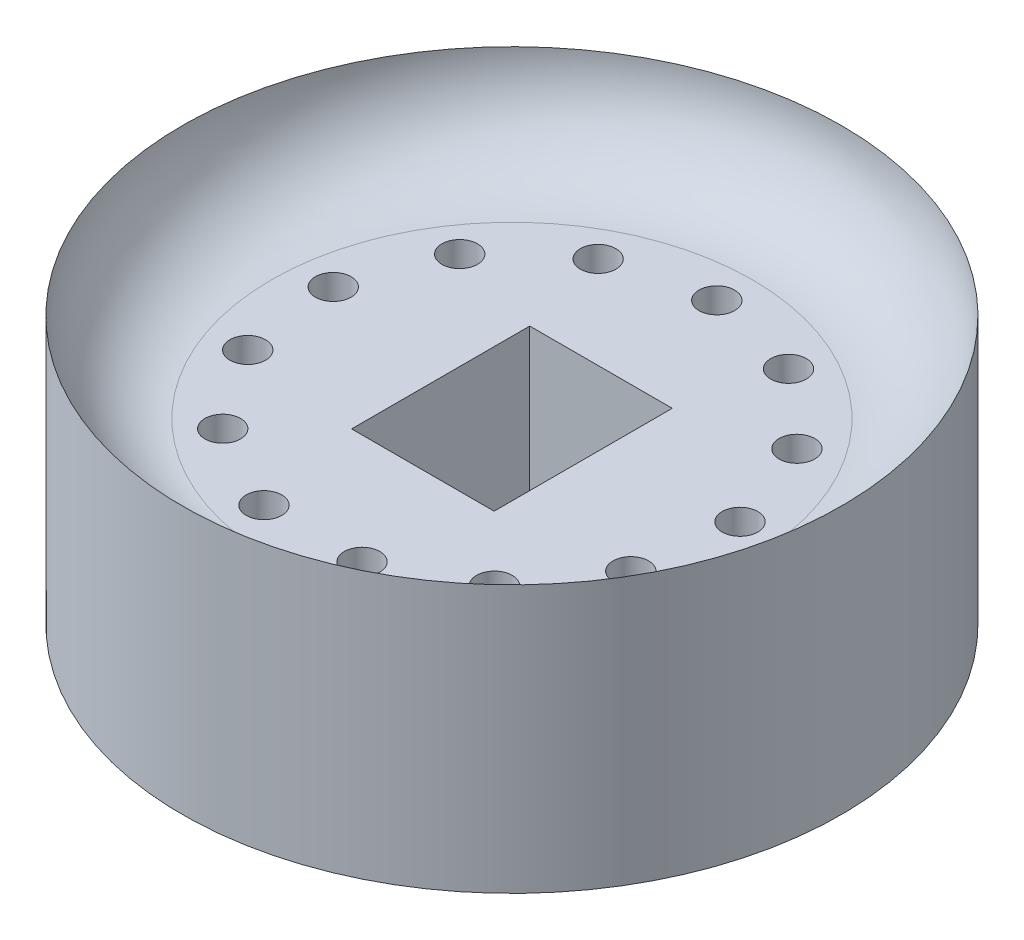
ISO-10303-21;
HEADER;
FILE_DESCRIPTION(('STEP AP214'),'2;1');
FILE_NAME('part.step','',(''),(''),'','','');
FILE_SCHEMA(('AUTOMOTIVE_DESIGN { 1 0 10303 214 1 1 1 1 }'));
ENDSEC;
DATA;
#1=APPLICATION_CONTEXT('core data for automotive mechanical design processes');
#2=APPLICATION_PROTOCOL_DEFINITION('international standard','automotive_design',2000,#1);
#3=PRODUCT_CONTEXT('',#1,'mechanical');
#4=PRODUCT('Part','Part','',(#3));
#5=PRODUCT_RELATED_PRODUCT_CATEGORY('part','',(#4));
#6=PRODUCT_DEFINITION_FORMATION('','',#4);
#7=PRODUCT_DEFINITION_CONTEXT('part definition',#1,'design');
#8=PRODUCT_DEFINITION('design','',#6,#7);
#9=PRODUCT_DEFINITION_SHAPE('','',#8);
#10=(LENGTH_UNIT() NAMED_UNIT(*) SI_UNIT(.MILLI.,.METRE.));
#11=(NAMED_UNIT(*) PLANE_ANGLE_UNIT() SI_UNIT($,.RADIAN.));
#12=(NAMED_UNIT(*) SI_UNIT($,.STERADIAN.) SOLID_ANGLE_UNIT());
#13=UNCERTAINTY_MEASURE_WITH_UNIT(LENGTH_MEASURE(1.E-05),#10,'distance_accuracy_value','');
#14=(GEOMETRIC_REPRESENTATION_CONTEXT(3) GLOBAL_UNCERTAINTY_ASSIGNED_CONTEXT((#13)) GLOBAL_UNIT_ASSIGNED_CONTEXT((#10,
#11,#12)) REPRESENTATION_CONTEXT('',''));
#15=CARTESIAN_POINT('',(0.,0.,0.));
#16=DIRECTION('',(0.,0.,1.));
#17=DIRECTION('',(1.,0.,0.));
#18=AXIS2_PLACEMENT_3D('',#15,#16,#17);
#19=CARTESIAN_POINT('',(0.,7.5,0.));
#20=DIRECTION('',(0.,-1.,0.));
#21=DIRECTION('',(0.,0.,-1.));
#22=AXIS2_PLACEMENT_3D('',#19,#20,#21);
#23=TOROIDAL_SURFACE('',#22,6.75,2.5);
#24=CARTESIAN_POINT('',(0.,7.5,0.));
#25=DIRECTION('',(0.,-1.,0.));
#26=DIRECTION('',(0.,0.,-1.));
#27=AXIS2_PLACEMENT_3D('',#24,#25,#26);
#28=CIRCLE('',#27,9.25);
#29=CARTESIAN_POINT('',(0.,7.5,-9.25));
#30=VERTEX_POINT('',#29);
#31=EDGE_CURVE('E203',#30,#30,#28,.T.);
#32=ORIENTED_EDGE('',*,*,#31,.F.);
#33=EDGE_LOOP('',(#32));
#34=FACE_BOUND('',#33,.T.);
#35=CARTESIAN_POINT('',(0.,5.,0.));
#36=DIRECTION('',(0.,-1.,0.));
#37=DIRECTION('',(0.,0.,-1.));
#38=AXIS2_PLACEMENT_3D('',#35,#36,#37);
#39=CIRCLE('',#38,6.75);
#40=CARTESIAN_POINT('',(0.,5.,-6.75));
#41=VERTEX_POINT('',#40);
#42=EDGE_CURVE('E11',#41,#41,#39,.T.);
#43=ORIENTED_EDGE('',*,*,#42,.T.);
#44=EDGE_LOOP('',(#43));
#45=FACE_BOUND('',#44,.T.);
#46=ADVANCED_FACE('F41',(#34,#45),#23,.F.);
#47=CARTESIAN_POINT('',(0.,5.,0.));
#48=DIRECTION('',(0.,1.,0.));
#49=DIRECTION('',(0.,0.,1.));
#50=AXIS2_PLACEMENT_3D('',#47,#48,#49);
#51=PLANE('',#50);
#52=CARTESIAN_POINT('',(-2.67215823925165,5.,-5.09137214750587));
#53=DIRECTION('',(0.,1.,0.));
#54=DIRECTION('',(0.,0.,1.));
#55=AXIS2_PLACEMENT_3D('',#52,#53,#54);
#56=CIRCLE('',#55,0.5);
#57=CARTESIAN_POINT('',(-2.67215823925165,5.,-4.59137214750587));
#58=VERTEX_POINT('',#57);
#59=EDGE_CURVE('E195',#58,#58,#56,.T.);
#60=ORIENTED_EDGE('',*,*,#59,.F.);
#61=EDGE_LOOP('',(#60));
#62=FACE_BOUND('',#61,.T.);
#63=CARTESIAN_POINT('',(-4.73215722888845,5.,-3.26637229370399));
#64=DIRECTION('',(0.,1.,0.));
#65=DIRECTION('',(0.,0.,1.));
#66=AXIS2_PLACEMENT_3D('',#63,#64,#65);
#67=CIRCLE('',#66,0.5);
#68=CARTESIAN_POINT('',(-4.73215722888845,5.,-2.76637229370399));
#69=VERTEX_POINT('',#68);
#70=EDGE_CURVE('E187',#69,#69,#67,.T.);
#71=ORIENTED_EDGE('',*,*,#70,.F.);
#72=EDGE_LOOP('',(#71));
#73=FACE_BOUND('',#72,.T.);
#74=CARTESIAN_POINT('',(-5.70807602606365,5.,-0.693085911467919));
#75=DIRECTION('',(0.,1.,0.));
#76=DIRECTION('',(0.,0.,1.));
#77=AXIS2_PLACEMENT_3D('',#74,#75,#76);
#78=CIRCLE('',#77,0.500000000000001);
#79=CARTESIAN_POINT('',(-5.70807602606365,5.,-0.193085911467918));
#80=VERTEX_POINT('',#79);
#81=EDGE_CURVE('E179',#80,#80,#78,.T.);
#82=ORIENTED_EDGE('',*,*,#81,.F.);
#83=EDGE_LOOP('',(#82));
#84=FACE_BOUND('',#83,.T.);
#85=CARTESIAN_POINT('',(-5.37634339544088,5.,2.03897810049475));
#86=DIRECTION('',(0.,1.,0.));
#87=DIRECTION('',(0.,0.,1.));
#88=AXIS2_PLACEMENT_3D('',#85,#86,#87);
#89=CIRCLE('',#88,0.500000000000001);
#90=CARTESIAN_POINT('',(-5.37634339544088,5.,2.53897810049476));
#91=VERTEX_POINT('',#90);
#92=EDGE_CURVE('E171',#91,#91,#89,.T.);
#93=ORIENTED_EDGE('',*,*,#92,.F.);
#94=EDGE_LOOP('',(#93));
#95=FACE_BOUND('',#94,.T.);
#96=CARTESIAN_POINT('',(-3.81295528488425,5.,4.30393680198396));
#97=DIRECTION('',(0.,1.,0.));
#98=DIRECTION('',(0.,0.,1.));
#99=AXIS2_PLACEMENT_3D('',#96,#97,#98);
#100=CIRCLE('',#99,0.5);
#101=CARTESIAN_POINT('',(-3.81295528488425,5.,4.80393680198396));
#102=VERTEX_POINT('',#101);
#103=EDGE_CURVE('E163',#102,#102,#100,.T.);
#104=ORIENTED_EDGE('',*,*,#103,.F.);
#105=EDGE_LOOP('',(#104));
#106=FACE_BOUND('',#105,.T.);
#107=DIRECTION('',(0.,0.,-1.));
#108=VECTOR('',#107,1.);
#109=CARTESIAN_POINT('',(2.,5.,2.5));
#110=LINE('',#109,#108);
#111=CARTESIAN_POINT('',(2.,5.,2.5));
#112=VERTEX_POINT('',#111);
#113=CARTESIAN_POINT('',(2.,5.,-2.5));
#114=VERTEX_POINT('',#113);
#115=EDGE_CURVE('E56',#112,#114,#110,.T.);
#116=ORIENTED_EDGE('',*,*,#115,.F.);
#117=DIRECTION('',(1.,0.,0.));
#118=VECTOR('',#117,1.);
#119=CARTESIAN_POINT('',(-2.,5.,2.5));
#120=LINE('',#119,#118);
#121=CARTESIAN_POINT('',(-2.,5.,2.5));
#122=VERTEX_POINT('',#121);
#123=EDGE_CURVE('E103',#122,#112,#120,.T.);
#124=ORIENTED_EDGE('',*,*,#123,.F.);
#125=DIRECTION('',(0.,0.,1.));
#126=VECTOR('',#125,1.);
#127=CARTESIAN_POINT('',(-2.,5.,2.5));
#128=LINE('',#127,#126);
#129=CARTESIAN_POINT('',(-2.,5.,-2.5));
#130=VERTEX_POINT('',#129);
#131=EDGE_CURVE('E107',#130,#122,#128,.T.);
#132=ORIENTED_EDGE('',*,*,#131,.F.);
#133=DIRECTION('',(-1.,0.,0.));
#134=VECTOR('',#133,1.);
#135=CARTESIAN_POINT('',(-2.,5.,-2.5));
#136=LINE('',#135,#134);
#137=EDGE_CURVE('E119',#114,#130,#136,.T.);
#138=ORIENTED_EDGE('',*,*,#137,.F.);
#139=EDGE_LOOP('',(#116,#124,#132,#138));
#140=FACE_BOUND('',#139,.T.);
#141=CARTESIAN_POINT('',(2.67215823925169,5.,-5.09137214750605));
#142=DIRECTION('',(0.,1.,0.));
#143=DIRECTION('',(0.,0.,1.));
#144=AXIS2_PLACEMENT_3D('',#141,#142,#143);
#145=CIRCLE('',#144,0.5);
#146=CARTESIAN_POINT('',(2.67215823925169,5.,-4.59137214750604));
#147=VERTEX_POINT('',#146);
#148=EDGE_CURVE('E138',#147,#147,#145,.T.);
#149=ORIENTED_EDGE('',*,*,#148,.F.);
#150=EDGE_LOOP('',(#149));
#151=FACE_BOUND('',#150,.T.);
#152=CARTESIAN_POINT('',(4.7321572288886,5.,-3.2663722937043));
#153=DIRECTION('',(0.,1.,0.));
#154=DIRECTION('',(0.,0.,1.));
#155=AXIS2_PLACEMENT_3D('',#152,#153,#154);
#156=CIRCLE('',#155,0.5);
#157=CARTESIAN_POINT('',(4.7321572288886,5.,-2.7663722937043));
#158=VERTEX_POINT('',#157);
#159=EDGE_CURVE('E146',#158,#158,#156,.T.);
#160=ORIENTED_EDGE('',*,*,#159,.F.);
#161=EDGE_LOOP('',(#160));
#162=FACE_BOUND('',#161,.T.);
#163=CARTESIAN_POINT('',(5.70807602606397,5.,-0.693085911468293));
#164=DIRECTION('',(0.,1.,0.));
#165=DIRECTION('',(0.,0.,1.));
#166=AXIS2_PLACEMENT_3D('',#163,#164,#165);
#167=CIRCLE('',#166,0.500000000000001);
#168=CARTESIAN_POINT('',(5.70807602606397,5.,-0.193085911468292));
#169=VERTEX_POINT('',#168);
#170=EDGE_CURVE('E154',#169,#169,#167,.T.);
#171=ORIENTED_EDGE('',*,*,#170,.F.);
#172=EDGE_LOOP('',(#171));
#173=FACE_BOUND('',#172,.T.);
#174=CARTESIAN_POINT('',(5.37634339544139,5.,2.03897810049441));
#175=DIRECTION('',(0.,1.,0.));
#176=DIRECTION('',(0.,0.,1.));
#177=AXIS2_PLACEMENT_3D('',#174,#175,#176);
#178=CIRCLE('',#177,0.500000000000001);
#179=CARTESIAN_POINT('',(5.37634339544139,5.,2.53897810049441));
#180=VERTEX_POINT('',#179);
#181=EDGE_CURVE('E262',#180,#180,#178,.T.);
#182=ORIENTED_EDGE('',*,*,#181,.F.);
#183=EDGE_LOOP('',(#182));
#184=FACE_BOUND('',#183,.T.);
#185=CARTESIAN_POINT('',(3.8129552848849,5.,4.30393680198371));
#186=DIRECTION('',(0.,1.,0.));
#187=DIRECTION('',(0.,0.,1.));
#188=AXIS2_PLACEMENT_3D('',#185,#186,#187);
#189=CIRCLE('',#188,0.500000000000001);
#190=CARTESIAN_POINT('',(3.8129552848849,5.,4.80393680198371));
#191=VERTEX_POINT('',#190);
#192=EDGE_CURVE('E266',#191,#191,#189,.T.);
#193=ORIENTED_EDGE('',*,*,#192,.F.);
#194=EDGE_LOOP('',(#193));
#195=FACE_BOUND('',#194,.T.);
#196=CARTESIAN_POINT('',(1.37606506965382,5.,5.58291545019975));
#197=DIRECTION('',(0.,1.,0.));
#198=DIRECTION('',(0.,0.,1.));
#199=AXIS2_PLACEMENT_3D('',#196,#197,#198);
#200=CIRCLE('',#199,0.499999999999999);
#201=CARTESIAN_POINT('',(1.37606506965382,5.,6.08291545019975));
#202=VERTEX_POINT('',#201);
#203=EDGE_CURVE('E270',#202,#202,#200,.T.);
#204=ORIENTED_EDGE('',*,*,#203,.F.);
#205=EDGE_LOOP('',(#204));
#206=FACE_BOUND('',#205,.T.);
#207=CARTESIAN_POINT('',(-1.37606506965309,5.,5.58291545019984));
#208=DIRECTION('',(0.,1.,0.));
#209=DIRECTION('',(0.,0.,1.));
#210=AXIS2_PLACEMENT_3D('',#207,#208,#209);
#211=CIRCLE('',#210,0.5);
#212=CARTESIAN_POINT('',(-1.37606506965309,5.,6.08291545019984));
#213=VERTEX_POINT('',#212);
#214=EDGE_CURVE('E110',#213,#213,#211,.T.);
#215=ORIENTED_EDGE('',*,*,#214,.F.);
#216=EDGE_LOOP('',(#215));
#217=FACE_BOUND('',#216,.T.);
#218=CARTESIAN_POINT('',(0.,5.,-5.75));
#219=DIRECTION('',(0.,1.,0.));
#220=DIRECTION('',(0.,0.,1.));
#221=AXIS2_PLACEMENT_3D('',#218,#219,#220);
#222=CIRCLE('',#221,0.5);
#223=CARTESIAN_POINT('',(0.,5.,-5.25));
#224=VERTEX_POINT('',#223);
#225=EDGE_CURVE('E129',#224,#224,#222,.T.);
#226=ORIENTED_EDGE('',*,*,#225,.F.);
#227=EDGE_LOOP('',(#226));
#228=FACE_BOUND('',#227,.T.);
#229=ORIENTED_EDGE('',*,*,#42,.F.);
#230=EDGE_LOOP('',(#229));
#231=FACE_BOUND('',#230,.T.);
#232=ADVANCED_FACE('F226',(#62,#73,#84,#95,#106,#140,#151,#162,#173,#184,#195,#206,#217,#228,
#231),#51,.T.);
#233=CARTESIAN_POINT('',(0.,0.,0.));
#234=DIRECTION('',(0.,-1.,0.));
#235=DIRECTION('',(0.,0.,-1.));
#236=AXIS2_PLACEMENT_3D('',#233,#234,#235);
#237=PLANE('',#236);
#238=CARTESIAN_POINT('',(-2.67215823925165,0.,-5.09137214750587));
#239=DIRECTION('',(0.,1.,0.));
#240=DIRECTION('',(0.,0.,1.));
#241=AXIS2_PLACEMENT_3D('',#238,#239,#240);
#242=CIRCLE('',#241,0.5);
#243=CARTESIAN_POINT('',(-2.67215823925165,0.,-4.59137214750587));
#244=VERTEX_POINT('',#243);
#245=EDGE_CURVE('E191',#244,#244,#242,.T.);
#246=ORIENTED_EDGE('',*,*,#245,.T.);
#247=EDGE_LOOP('',(#246));
#248=FACE_BOUND('',#247,.T.);
#249=CARTESIAN_POINT('',(-4.73215722888845,0.,-3.26637229370399));
#250=DIRECTION('',(0.,1.,0.));
#251=DIRECTION('',(0.,0.,1.));
#252=AXIS2_PLACEMENT_3D('',#249,#250,#251);
#253=CIRCLE('',#252,0.5);
#254=CARTESIAN_POINT('',(-4.73215722888845,0.,-2.76637229370399));
#255=VERTEX_POINT('',#254);
#256=EDGE_CURVE('E183',#255,#255,#253,.T.);
#257=ORIENTED_EDGE('',*,*,#256,.T.);
#258=EDGE_LOOP('',(#257));
#259=FACE_BOUND('',#258,.T.);
#260=CARTESIAN_POINT('',(-5.70807602606365,0.,-0.693085911467919));
#261=DIRECTION('',(0.,1.,0.));
#262=DIRECTION('',(0.,0.,1.));
#263=AXIS2_PLACEMENT_3D('',#260,#261,#262);
#264=CIRCLE('',#263,0.500000000000001);
#265=CARTESIAN_POINT('',(-5.70807602606365,0.,-0.193085911467918));
#266=VERTEX_POINT('',#265);
#267=EDGE_CURVE('E175',#266,#266,#264,.T.);
#268=ORIENTED_EDGE('',*,*,#267,.T.);
#269=EDGE_LOOP('',(#268));
#270=FACE_BOUND('',#269,.T.);
#271=CARTESIAN_POINT('',(-5.37634339544088,0.,2.03897810049475));
#272=DIRECTION('',(0.,1.,0.));
#273=DIRECTION('',(0.,0.,1.));
#274=AXIS2_PLACEMENT_3D('',#271,#272,#273);
#275=CIRCLE('',#274,0.500000000000001);
#276=CARTESIAN_POINT('',(-5.37634339544088,0.,2.53897810049476));
#277=VERTEX_POINT('',#276);
#278=EDGE_CURVE('E167',#277,#277,#275,.T.);
#279=ORIENTED_EDGE('',*,*,#278,.T.);
#280=EDGE_LOOP('',(#279));
#281=FACE_BOUND('',#280,.T.);
#282=CARTESIAN_POINT('',(-3.81295528488425,0.,4.30393680198396));
#283=DIRECTION('',(0.,1.,0.));
#284=DIRECTION('',(0.,0.,1.));
#285=AXIS2_PLACEMENT_3D('',#282,#283,#284);
#286=CIRCLE('',#285,0.5);
#287=CARTESIAN_POINT('',(-3.81295528488425,0.,4.80393680198396));
#288=VERTEX_POINT('',#287);
#289=EDGE_CURVE('E159',#288,#288,#286,.T.);
#290=ORIENTED_EDGE('',*,*,#289,.T.);
#291=EDGE_LOOP('',(#290));
#292=FACE_BOUND('',#291,.T.);
#293=DIRECTION('',(0.,0.,-1.));
#294=VECTOR('',#293,1.);
#295=CARTESIAN_POINT('',(2.,0.,2.5));
#296=LINE('',#295,#294);
#297=CARTESIAN_POINT('',(2.,0.,2.5));
#298=VERTEX_POINT('',#297);
#299=CARTESIAN_POINT('',(2.,0.,-2.5));
#300=VERTEX_POINT('',#299);
#301=EDGE_CURVE('E84',#298,#300,#296,.T.);
#302=ORIENTED_EDGE('',*,*,#301,.T.);
#303=DIRECTION('',(-1.,0.,0.));
#304=VECTOR('',#303,1.);
#305=CARTESIAN_POINT('',(-2.,0.,-2.5));
#306=LINE('',#305,#304);
#307=CARTESIAN_POINT('',(-2.,0.,-2.5));
#308=VERTEX_POINT('',#307);
#309=EDGE_CURVE('E94',#300,#308,#306,.T.);
#310=ORIENTED_EDGE('',*,*,#309,.T.);
#311=DIRECTION('',(0.,0.,1.));
#312=VECTOR('',#311,1.);
#313=CARTESIAN_POINT('',(-2.,0.,2.5));
#314=LINE('',#313,#312);
#315=CARTESIAN_POINT('',(-2.,0.,2.5));
#316=VERTEX_POINT('',#315);
#317=EDGE_CURVE('E64',#308,#316,#314,.T.);
#318=ORIENTED_EDGE('',*,*,#317,.T.);
#319=DIRECTION('',(1.,0.,0.));
#320=VECTOR('',#319,1.);
#321=CARTESIAN_POINT('',(-2.,0.,2.5));
#322=LINE('',#321,#320);
#323=EDGE_CURVE('E91',#316,#298,#322,.T.);
#324=ORIENTED_EDGE('',*,*,#323,.T.);
#325=EDGE_LOOP('',(#302,#310,#318,#324));
#326=FACE_BOUND('',#325,.T.);
#327=CARTESIAN_POINT('',(2.67215823925169,0.,-5.09137214750605));
#328=DIRECTION('',(0.,1.,0.));
#329=DIRECTION('',(0.,0.,1.));
#330=AXIS2_PLACEMENT_3D('',#327,#328,#329);
#331=CIRCLE('',#330,0.5);
#332=CARTESIAN_POINT('',(2.67215823925169,0.,-4.59137214750604));
#333=VERTEX_POINT('',#332);
#334=EDGE_CURVE('E120',#333,#333,#331,.T.);
#335=ORIENTED_EDGE('',*,*,#334,.T.);
#336=EDGE_LOOP('',(#335));
#337=FACE_BOUND('',#336,.T.);
#338=CARTESIAN_POINT('',(4.7321572288886,0.,-3.2663722937043));
#339=DIRECTION('',(0.,1.,0.));
#340=DIRECTION('',(0.,0.,1.));
#341=AXIS2_PLACEMENT_3D('',#338,#339,#340);
#342=CIRCLE('',#341,0.5);
#343=CARTESIAN_POINT('',(4.7321572288886,0.,-2.7663722937043));
#344=VERTEX_POINT('',#343);
#345=EDGE_CURVE('E142',#344,#344,#342,.T.);
#346=ORIENTED_EDGE('',*,*,#345,.T.);
#347=EDGE_LOOP('',(#346));
#348=FACE_BOUND('',#347,.T.);
#349=CARTESIAN_POINT('',(5.70807602606397,0.,-0.693085911468293));
#350=DIRECTION('',(0.,1.,0.));
#351=DIRECTION('',(0.,0.,1.));
#352=AXIS2_PLACEMENT_3D('',#349,#350,#351);
#353=CIRCLE('',#352,0.500000000000001);
#354=CARTESIAN_POINT('',(5.70807602606397,0.,-0.193085911468292));
#355=VERTEX_POINT('',#354);
#356=EDGE_CURVE('E150',#355,#355,#353,.T.);
#357=ORIENTED_EDGE('',*,*,#356,.T.);
#358=EDGE_LOOP('',(#357));
#359=FACE_BOUND('',#358,.T.);
#360=CARTESIAN_POINT('',(5.37634339544139,0.,2.03897810049441));
#361=DIRECTION('',(0.,1.,0.));
#362=DIRECTION('',(0.,0.,1.));
#363=AXIS2_PLACEMENT_3D('',#360,#361,#362);
#364=CIRCLE('',#363,0.500000000000001);
#365=CARTESIAN_POINT('',(5.37634339544139,0.,2.53897810049441));
#366=VERTEX_POINT('',#365);
#367=EDGE_CURVE('E158',#366,#366,#364,.T.);
#368=ORIENTED_EDGE('',*,*,#367,.T.);
#369=EDGE_LOOP('',(#368));
#370=FACE_BOUND('',#369,.T.);
#371=CARTESIAN_POINT('',(3.8129552848849,0.,4.30393680198371));
#372=DIRECTION('',(0.,1.,0.));
#373=DIRECTION('',(0.,0.,1.));
#374=AXIS2_PLACEMENT_3D('',#371,#372,#373);
#375=CIRCLE('',#374,0.500000000000001);
#376=CARTESIAN_POINT('',(3.8129552848849,0.,4.80393680198371));
#377=VERTEX_POINT('',#376);
#378=EDGE_CURVE('E292',#377,#377,#375,.T.);
#379=ORIENTED_EDGE('',*,*,#378,.T.);
#380=EDGE_LOOP('',(#379));
#381=FACE_BOUND('',#380,.T.);
#382=CARTESIAN_POINT('',(1.37606506965382,0.,5.58291545019975));
#383=DIRECTION('',(0.,1.,0.));
#384=DIRECTION('',(0.,0.,1.));
#385=AXIS2_PLACEMENT_3D('',#382,#383,#384);
#386=CIRCLE('',#385,0.499999999999999);
#387=CARTESIAN_POINT('',(1.37606506965382,0.,6.08291545019975));
#388=VERTEX_POINT('',#387);
#389=EDGE_CURVE('E284',#388,#388,#386,.T.);
#390=ORIENTED_EDGE('',*,*,#389,.T.);
#391=EDGE_LOOP('',(#390));
#392=FACE_BOUND('',#391,.T.);
#393=CARTESIAN_POINT('',(-1.37606506965309,0.,5.58291545019984));
#394=DIRECTION('',(0.,1.,0.));
#395=DIRECTION('',(0.,0.,1.));
#396=AXIS2_PLACEMENT_3D('',#393,#394,#395);
#397=CIRCLE('',#396,0.5);
#398=CARTESIAN_POINT('',(-1.37606506965309,0.,6.08291545019984));
#399=VERTEX_POINT('',#398);
#400=EDGE_CURVE('E278',#399,#399,#397,.T.);
#401=ORIENTED_EDGE('',*,*,#400,.T.);
#402=EDGE_LOOP('',(#401));
#403=FACE_BOUND('',#402,.T.);
#404=CARTESIAN_POINT('',(0.,0.,-5.75));
#405=DIRECTION('',(0.,1.,0.));
#406=DIRECTION('',(0.,0.,1.));
#407=AXIS2_PLACEMENT_3D('',#404,#405,#406);
#408=CIRCLE('',#407,0.5);
#409=CARTESIAN_POINT('',(0.,0.,-5.25));
#410=VERTEX_POINT('',#409);
#411=EDGE_CURVE('E199',#410,#410,#408,.T.);
#412=ORIENTED_EDGE('',*,*,#411,.T.);
#413=EDGE_LOOP('',(#412));
#414=FACE_BOUND('',#413,.T.);
#415=CARTESIAN_POINT('',(0.,0.,0.));
#416=DIRECTION('',(0.,-1.,0.));
#417=DIRECTION('',(0.,0.,-1.));
#418=AXIS2_PLACEMENT_3D('',#415,#416,#417);
#419=CIRCLE('',#418,9.25);
#420=CARTESIAN_POINT('',(0.,0.,-9.25));
#421=VERTEX_POINT('',#420);
#422=EDGE_CURVE('E49',#421,#421,#419,.T.);
#423=ORIENTED_EDGE('',*,*,#422,.T.);
#424=EDGE_LOOP('',(#423));
#425=FACE_BOUND('',#424,.T.);
#426=ADVANCED_FACE('F99',(#248,#259,#270,#281,#292,#326,#337,#348,#359,#370,#381,#392,#403,#414,
#425),#237,.T.);
#427=CARTESIAN_POINT('',(0.,0.,0.));
#428=DIRECTION('',(0.,-1.,0.));
#429=DIRECTION('',(0.,0.,-1.));
#430=AXIS2_PLACEMENT_3D('',#427,#428,#429);
#431=CYLINDRICAL_SURFACE('',#430,9.25);
#432=ORIENTED_EDGE('',*,*,#31,.T.);
#433=EDGE_LOOP('',(#432));
#434=FACE_BOUND('',#433,.T.);
#435=ORIENTED_EDGE('',*,*,#422,.F.);
#436=EDGE_LOOP('',(#435));
#437=FACE_BOUND('',#436,.T.);
#438=ADVANCED_FACE('F214',(#434,#437),#431,.T.);
#439=CARTESIAN_POINT('',(0.,0.,-5.75));
#440=DIRECTION('',(0.,1.,0.));
#441=DIRECTION('',(0.,0.,1.));
#442=AXIS2_PLACEMENT_3D('',#439,#440,#441);
#443=CYLINDRICAL_SURFACE('',#442,0.5);
#444=ORIENTED_EDGE('',*,*,#411,.F.);
#445=EDGE_LOOP('',(#444));
#446=FACE_BOUND('',#445,.T.);
#447=ORIENTED_EDGE('',*,*,#225,.T.);
#448=EDGE_LOOP('',(#447));
#449=FACE_BOUND('',#448,.T.);
#450=ADVANCED_FACE('F216',(#446,#449),#443,.F.);
#451=CARTESIAN_POINT('',(-1.37606506965309,0.,5.58291545019984));
#452=DIRECTION('',(0.,1.,0.));
#453=DIRECTION('',(0.,0.,1.));
#454=AXIS2_PLACEMENT_3D('',#451,#452,#453);
#455=CYLINDRICAL_SURFACE('',#454,0.5);
#456=ORIENTED_EDGE('',*,*,#400,.F.);
#457=EDGE_LOOP('',(#456));
#458=FACE_BOUND('',#457,.T.);
#459=ORIENTED_EDGE('',*,*,#214,.T.);
#460=EDGE_LOOP('',(#459));
#461=FACE_BOUND('',#460,.T.);
#462=ADVANCED_FACE('F223',(#458,#461),#455,.F.);
#463=CARTESIAN_POINT('',(1.37606506965382,0.,5.58291545019975));
#464=DIRECTION('',(0.,1.,0.));
#465=DIRECTION('',(0.,0.,1.));
#466=AXIS2_PLACEMENT_3D('',#463,#464,#465);
#467=CYLINDRICAL_SURFACE('',#466,0.499999999999999);
#468=ORIENTED_EDGE('',*,*,#389,.F.);
#469=EDGE_LOOP('',(#468));
#470=FACE_BOUND('',#469,.T.);
#471=ORIENTED_EDGE('',*,*,#203,.T.);
#472=EDGE_LOOP('',(#471));
#473=FACE_BOUND('',#472,.T.);
#474=ADVANCED_FACE('F317',(#470,#473),#467,.F.);
#475=CARTESIAN_POINT('',(3.8129552848849,0.,4.30393680198371));
#476=DIRECTION('',(0.,1.,0.));
#477=DIRECTION('',(0.,0.,1.));
#478=AXIS2_PLACEMENT_3D('',#475,#476,#477);
#479=CYLINDRICAL_SURFACE('',#478,0.500000000000001);
#480=ORIENTED_EDGE('',*,*,#378,.F.);
#481=EDGE_LOOP('',(#480));
#482=FACE_BOUND('',#481,.T.);
#483=ORIENTED_EDGE('',*,*,#192,.T.);
#484=EDGE_LOOP('',(#483));
#485=FACE_BOUND('',#484,.T.);
#486=ADVANCED_FACE('F308',(#482,#485),#479,.F.);
#487=CARTESIAN_POINT('',(5.37634339544139,0.,2.03897810049441));
#488=DIRECTION('',(0.,1.,0.));
#489=DIRECTION('',(0.,0.,1.));
#490=AXIS2_PLACEMENT_3D('',#487,#488,#489);
#491=CYLINDRICAL_SURFACE('',#490,0.500000000000001);
#492=ORIENTED_EDGE('',*,*,#367,.F.);
#493=EDGE_LOOP('',(#492));
#494=FACE_BOUND('',#493,.T.);
#495=ORIENTED_EDGE('',*,*,#181,.T.);
#496=EDGE_LOOP('',(#495));
#497=FACE_BOUND('',#496,.T.);
#498=ADVANCED_FACE('F304',(#494,#497),#491,.F.);
#499=CARTESIAN_POINT('',(5.70807602606397,0.,-0.693085911468293));
#500=DIRECTION('',(0.,1.,0.));
#501=DIRECTION('',(0.,0.,1.));
#502=AXIS2_PLACEMENT_3D('',#499,#500,#501);
#503=CYLINDRICAL_SURFACE('',#502,0.500000000000001);
#504=ORIENTED_EDGE('',*,*,#356,.F.);
#505=EDGE_LOOP('',(#504));
#506=FACE_BOUND('',#505,.T.);
#507=ORIENTED_EDGE('',*,*,#170,.T.);
#508=EDGE_LOOP('',(#507));
#509=FACE_BOUND('',#508,.T.);
#510=ADVANCED_FACE('F307',(#506,#509),#503,.F.);
#511=CARTESIAN_POINT('',(4.7321572288886,0.,-3.2663722937043));
#512=DIRECTION('',(0.,1.,0.));
#513=DIRECTION('',(0.,0.,1.));
#514=AXIS2_PLACEMENT_3D('',#511,#512,#513);
#515=CYLINDRICAL_SURFACE('',#514,0.5);
#516=ORIENTED_EDGE('',*,*,#345,.F.);
#517=EDGE_LOOP('',(#516));
#518=FACE_BOUND('',#517,.T.);
#519=ORIENTED_EDGE('',*,*,#159,.T.);
#520=EDGE_LOOP('',(#519));
#521=FACE_BOUND('',#520,.T.);
#522=ADVANCED_FACE('F314',(#518,#521),#515,.F.);
#523=CARTESIAN_POINT('',(2.67215823925169,0.,-5.09137214750605));
#524=DIRECTION('',(0.,1.,0.));
#525=DIRECTION('',(0.,0.,1.));
#526=AXIS2_PLACEMENT_3D('',#523,#524,#525);
#527=CYLINDRICAL_SURFACE('',#526,0.5);
#528=ORIENTED_EDGE('',*,*,#334,.F.);
#529=EDGE_LOOP('',(#528));
#530=FACE_BOUND('',#529,.T.);
#531=ORIENTED_EDGE('',*,*,#148,.T.);
#532=EDGE_LOOP('',(#531));
#533=FACE_BOUND('',#532,.T.);
#534=ADVANCED_FACE('F339',(#530,#533),#527,.F.);
#535=CARTESIAN_POINT('',(2.,0.,2.5));
#536=DIRECTION('',(1.,0.,0.));
#537=DIRECTION('',(0.,0.,-1.));
#538=AXIS2_PLACEMENT_3D('',#535,#536,#537);
#539=PLANE('',#538);
#540=ORIENTED_EDGE('',*,*,#115,.T.);
#541=DIRECTION('',(0.,1.,0.));
#542=VECTOR('',#541,1.);
#543=CARTESIAN_POINT('',(2.,0.,-2.5));
#544=LINE('',#543,#542);
#545=EDGE_CURVE('E80',#300,#114,#544,.T.);
#546=ORIENTED_EDGE('',*,*,#545,.F.);
#547=ORIENTED_EDGE('',*,*,#301,.F.);
#548=DIRECTION('',(0.,1.,0.));
#549=VECTOR('',#548,1.);
#550=CARTESIAN_POINT('',(2.,0.,2.5));
#551=LINE('',#550,#549);
#552=EDGE_CURVE('E126',#298,#112,#551,.T.);
#553=ORIENTED_EDGE('',*,*,#552,.T.);
#554=EDGE_LOOP('',(#540,#546,#547,#553));
#555=FACE_BOUND('',#554,.T.);
#556=ADVANCED_FACE('F82',(#555),#539,.F.);
#557=CARTESIAN_POINT('',(-2.,0.,2.5));
#558=DIRECTION('',(0.,0.,1.));
#559=DIRECTION('',(1.,0.,0.));
#560=AXIS2_PLACEMENT_3D('',#557,#558,#559);
#561=PLANE('',#560);
#562=ORIENTED_EDGE('',*,*,#123,.T.);
#563=ORIENTED_EDGE('',*,*,#552,.F.);
#564=ORIENTED_EDGE('',*,*,#323,.F.);
#565=DIRECTION('',(0.,1.,0.));
#566=VECTOR('',#565,1.);
#567=CARTESIAN_POINT('',(-2.,0.,2.5));
#568=LINE('',#567,#566);
#569=EDGE_CURVE('E130',#316,#122,#568,.T.);
#570=ORIENTED_EDGE('',*,*,#569,.T.);
#571=EDGE_LOOP('',(#562,#563,#564,#570));
#572=FACE_BOUND('',#571,.T.);
#573=ADVANCED_FACE('F327',(#572),#561,.F.);
#574=CARTESIAN_POINT('',(-2.,0.,2.5));
#575=DIRECTION('',(-1.,0.,0.));
#576=DIRECTION('',(0.,0.,1.));
#577=AXIS2_PLACEMENT_3D('',#574,#575,#576);
#578=PLANE('',#577);
#579=ORIENTED_EDGE('',*,*,#131,.T.);
#580=ORIENTED_EDGE('',*,*,#569,.F.);
#581=ORIENTED_EDGE('',*,*,#317,.F.);
#582=DIRECTION('',(0.,1.,0.));
#583=VECTOR('',#582,1.);
#584=CARTESIAN_POINT('',(-2.,0.,-2.5));
#585=LINE('',#584,#583);
#586=EDGE_CURVE('E90',#308,#130,#585,.T.);
#587=ORIENTED_EDGE('',*,*,#586,.T.);
#588=EDGE_LOOP('',(#579,#580,#581,#587));
#589=FACE_BOUND('',#588,.T.);
#590=ADVANCED_FACE('F330',(#589),#578,.F.);
#591=CARTESIAN_POINT('',(-2.,0.,-2.5));
#592=DIRECTION('',(0.,0.,-1.));
#593=DIRECTION('',(-1.,0.,0.));
#594=AXIS2_PLACEMENT_3D('',#591,#592,#593);
#595=PLANE('',#594);
#596=ORIENTED_EDGE('',*,*,#137,.T.);
#597=ORIENTED_EDGE('',*,*,#586,.F.);
#598=ORIENTED_EDGE('',*,*,#309,.F.);
#599=ORIENTED_EDGE('',*,*,#545,.T.);
#600=EDGE_LOOP('',(#596,#597,#598,#599));
#601=FACE_BOUND('',#600,.T.);
#602=ADVANCED_FACE('F95',(#601),#595,.F.);
#603=CARTESIAN_POINT('',(-3.81295528488425,0.,4.30393680198396));
#604=DIRECTION('',(0.,1.,0.));
#605=DIRECTION('',(0.,0.,1.));
#606=AXIS2_PLACEMENT_3D('',#603,#604,#605);
#607=CYLINDRICAL_SURFACE('',#606,0.5);
#608=ORIENTED_EDGE('',*,*,#289,.F.);
#609=EDGE_LOOP('',(#608));
#610=FACE_BOUND('',#609,.T.);
#611=ORIENTED_EDGE('',*,*,#103,.T.);
#612=EDGE_LOOP('',(#611));
#613=FACE_BOUND('',#612,.T.);
#614=ADVANCED_FACE('F336',(#610,#613),#607,.F.);
#615=CARTESIAN_POINT('',(-5.37634339544088,0.,2.03897810049475));
#616=DIRECTION('',(0.,1.,0.));
#617=DIRECTION('',(0.,0.,1.));
#618=AXIS2_PLACEMENT_3D('',#615,#616,#617);
#619=CYLINDRICAL_SURFACE('',#618,0.500000000000001);
#620=ORIENTED_EDGE('',*,*,#278,.F.);
#621=EDGE_LOOP('',(#620));
#622=FACE_BOUND('',#621,.T.);
#623=ORIENTED_EDGE('',*,*,#92,.T.);
#624=EDGE_LOOP('',(#623));
#625=FACE_BOUND('',#624,.T.);
#626=ADVANCED_FACE('F348',(#622,#625),#619,.F.);
#627=CARTESIAN_POINT('',(-5.70807602606365,0.,-0.693085911467919));
#628=DIRECTION('',(0.,1.,0.));
#629=DIRECTION('',(0.,0.,1.));
#630=AXIS2_PLACEMENT_3D('',#627,#628,#629);
#631=CYLINDRICAL_SURFACE('',#630,0.500000000000001);
#632=ORIENTED_EDGE('',*,*,#267,.F.);
#633=EDGE_LOOP('',(#632));
#634=FACE_BOUND('',#633,.T.);
#635=ORIENTED_EDGE('',*,*,#81,.T.);
#636=EDGE_LOOP('',(#635));
#637=FACE_BOUND('',#636,.T.);
#638=ADVANCED_FACE('F352',(#634,#637),#631,.F.);
#639=CARTESIAN_POINT('',(-4.73215722888845,0.,-3.26637229370399));
#640=DIRECTION('',(0.,1.,0.));
#641=DIRECTION('',(0.,0.,1.));
#642=AXIS2_PLACEMENT_3D('',#639,#640,#641);
#643=CYLINDRICAL_SURFACE('',#642,0.5);
#644=ORIENTED_EDGE('',*,*,#256,.F.);
#645=EDGE_LOOP('',(#644));
#646=FACE_BOUND('',#645,.T.);
#647=ORIENTED_EDGE('',*,*,#70,.T.);
#648=EDGE_LOOP('',(#647));
#649=FACE_BOUND('',#648,.T.);
#650=ADVANCED_FACE('F356',(#646,#649),#643,.F.);
#651=CARTESIAN_POINT('',(-2.67215823925165,0.,-5.09137214750587));
#652=DIRECTION('',(0.,1.,0.));
#653=DIRECTION('',(0.,0.,1.));
#654=AXIS2_PLACEMENT_3D('',#651,#652,#653);
#655=CYLINDRICAL_SURFACE('',#654,0.5);
#656=ORIENTED_EDGE('',*,*,#245,.F.);
#657=EDGE_LOOP('',(#656));
#658=FACE_BOUND('',#657,.T.);
#659=ORIENTED_EDGE('',*,*,#59,.T.);
#660=EDGE_LOOP('',(#659));
#661=FACE_BOUND('',#660,.T.);
#662=ADVANCED_FACE('F360',(#658,#661),#655,.F.);
#663=CLOSED_SHELL('',(#46,#232,#426,#438,#450,#462,#474,#486,#498,#510,#522,#534,#556,#573,#590,
#602,#614,#626,#638,#650,#662));
#664=MANIFOLD_SOLID_BREP('B2',#663);
#665=ADVANCED_BREP_SHAPE_REPRESENTATION('',(#18,#664),#14);
#666=SHAPE_DEFINITION_REPRESENTATION(#9,#665);
ENDSEC;
END-ISO-10303-21;
